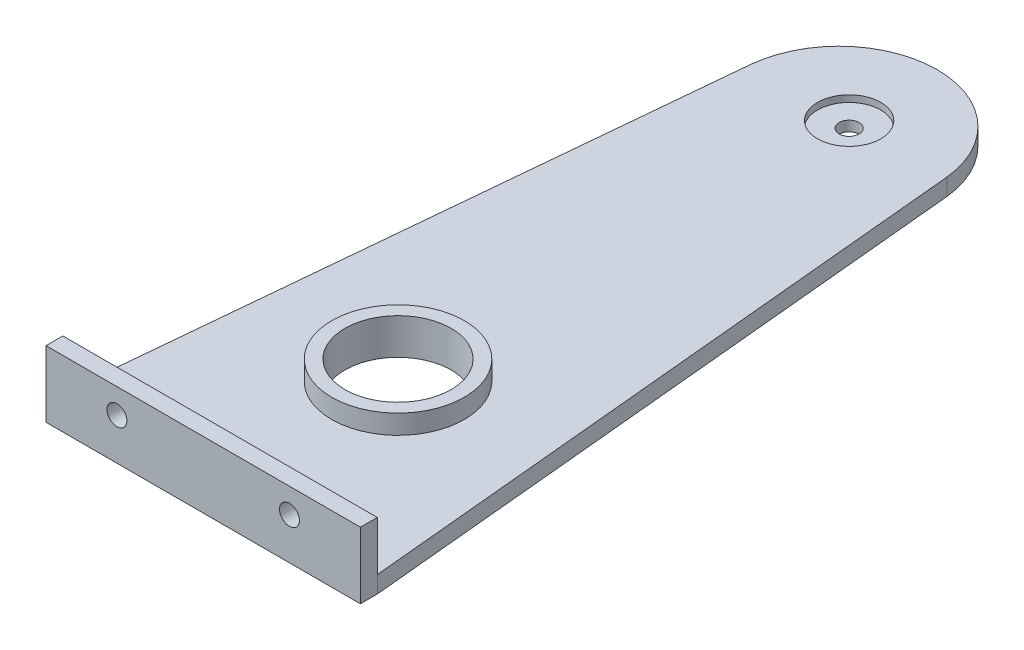
ISO-10303-21;
HEADER;
FILE_DESCRIPTION(('STEP AP214'),'2;1');
FILE_NAME('part.step','',(''),(''),'','','');
FILE_SCHEMA(('AUTOMOTIVE_DESIGN { 1 0 10303 214 1 1 1 1 }'));
ENDSEC;
DATA;
#1=APPLICATION_CONTEXT('core data for automotive mechanical design processes');
#2=APPLICATION_PROTOCOL_DEFINITION('international standard','automotive_design',2000,#1);
#3=PRODUCT_CONTEXT('',#1,'mechanical');
#4=PRODUCT('Part','Part','',(#3));
#5=PRODUCT_RELATED_PRODUCT_CATEGORY('part','',(#4));
#6=PRODUCT_DEFINITION_FORMATION('','',#4);
#7=PRODUCT_DEFINITION_CONTEXT('part definition',#1,'design');
#8=PRODUCT_DEFINITION('design','',#6,#7);
#9=PRODUCT_DEFINITION_SHAPE('','',#8);
#10=(LENGTH_UNIT() NAMED_UNIT(*) SI_UNIT(.MILLI.,.METRE.));
#11=(NAMED_UNIT(*) PLANE_ANGLE_UNIT() SI_UNIT($,.RADIAN.));
#12=(NAMED_UNIT(*) SI_UNIT($,.STERADIAN.) SOLID_ANGLE_UNIT());
#13=UNCERTAINTY_MEASURE_WITH_UNIT(LENGTH_MEASURE(1.E-05),#10,'distance_accuracy_value','');
#14=(GEOMETRIC_REPRESENTATION_CONTEXT(3) GLOBAL_UNCERTAINTY_ASSIGNED_CONTEXT((#13)) GLOBAL_UNIT_ASSIGNED_CONTEXT((#10,
#11,#12)) REPRESENTATION_CONTEXT('',''));
#15=CARTESIAN_POINT('',(0.,0.,0.));
#16=DIRECTION('',(0.,0.,1.));
#17=DIRECTION('',(1.,0.,0.));
#18=AXIS2_PLACEMENT_3D('',#15,#16,#17);
#19=CARTESIAN_POINT('',(-0.0202063432006589,-2.54,0.));
#20=DIRECTION('',(0.,1.,0.));
#21=DIRECTION('',(0.,0.,1.));
#22=AXIS2_PLACEMENT_3D('',#19,#20,#21);
#23=CYLINDRICAL_SURFACE('',#22,1.5);
#24=CARTESIAN_POINT('',(-0.0202063432006589,-2.54,0.));
#25=DIRECTION('',(0.,1.,0.));
#26=DIRECTION('',(0.,0.,1.));
#27=AXIS2_PLACEMENT_3D('',#24,#25,#26);
#28=CIRCLE('',#27,1.5);
#29=CARTESIAN_POINT('',(-0.0202063432006589,-2.54,1.50000000000003));
#30=VERTEX_POINT('',#29);
#31=EDGE_CURVE('E133',#30,#30,#28,.F.);
#32=ORIENTED_EDGE('',*,*,#31,.T.);
#33=EDGE_LOOP('',(#32));
#34=FACE_BOUND('',#33,.T.);
#35=CARTESIAN_POINT('',(-0.0202063432006589,-1.,0.));
#36=DIRECTION('',(0.,1.,0.));
#37=DIRECTION('',(0.,0.,1.));
#38=AXIS2_PLACEMENT_3D('',#35,#36,#37);
#39=CIRCLE('',#38,1.5);
#40=CARTESIAN_POINT('',(-0.0202063432006589,-1.,1.50000000000003));
#41=VERTEX_POINT('',#40);
#42=EDGE_CURVE('E182',#41,#41,#39,.F.);
#43=ORIENTED_EDGE('',*,*,#42,.F.);
#44=EDGE_LOOP('',(#43));
#45=FACE_BOUND('',#44,.T.);
#46=ADVANCED_FACE('F35',(#34,#45),#23,.F.);
#47=CARTESIAN_POINT('',(0.,0.,0.));
#48=DIRECTION('',(0.,1.,0.));
#49=DIRECTION('',(0.,0.,1.));
#50=AXIS2_PLACEMENT_3D('',#47,#48,#49);
#51=PLANE('',#50);
#52=CARTESIAN_POINT('',(-0.000200836754732192,0.,67.9999970572037));
#53=DIRECTION('',(0.,1.,0.));
#54=DIRECTION('',(0.,0.,1.));
#55=AXIS2_PLACEMENT_3D('',#52,#53,#54);
#56=CIRCLE('',#55,10.);
#57=CARTESIAN_POINT('',(-0.000200836754732192,0.,77.9999970572037));
#58=VERTEX_POINT('',#57);
#59=EDGE_CURVE('E11',#58,#58,#56,.T.);
#60=ORIENTED_EDGE('',*,*,#59,.F.);
#61=EDGE_LOOP('',(#60));
#62=FACE_BOUND('',#61,.T.);
#63=DIRECTION('',(0.0941057343410475,0.,0.995562208384856));
#64=VECTOR('',#63,1.);
#65=CARTESIAN_POINT('',(14.5881691243835,0.,-1.37894986026911));
#66=LINE('',#65,#64);
#67=CARTESIAN_POINT('',(14.7185146599283,0.,0.));
#68=VERTEX_POINT('',#67);
#69=CARTESIAN_POINT('',(23.6803571196277,0.,94.8090117233565));
#70=VERTEX_POINT('',#69);
#71=EDGE_CURVE('E125',#68,#70,#66,.T.);
#72=ORIENTED_EDGE('',*,*,#71,.F.);
#73=CARTESIAN_POINT('',(-0.0202063432006572,0.,1.53641351594778));
#74=DIRECTION('',(0.,1.,0.));
#75=DIRECTION('',(0.,0.,1.));
#76=AXIS2_PLACEMENT_3D('',#73,#74,#75);
#77=CIRCLE('',#76,14.8185850640357);
#78=CARTESIAN_POINT('',(-14.7589273463297,0.,0.));
#79=VERTEX_POINT('',#78);
#80=EDGE_CURVE('E127',#68,#79,#77,.T.);
#81=ORIENTED_EDGE('',*,*,#80,.T.);
#82=DIRECTION('',(-0.0938954260904472,0.,0.995582065406611));
#83=VECTOR('',#82,1.);
#84=CARTESIAN_POINT('',(-14.6288074618601,0.,-1.37967341674187));
#85=LINE('',#84,#83);
#86=CARTESIAN_POINT('',(-23.700563462829,0.,94.8090117233565));
#87=VERTEX_POINT('',#86);
#88=EDGE_CURVE('E146',#79,#87,#85,.T.);
#89=ORIENTED_EDGE('',*,*,#88,.T.);
#90=DIRECTION('',(-1.,0.,0.));
#91=VECTOR('',#90,1.);
#92=CARTESIAN_POINT('',(0.,0.,94.8090117233565));
#93=LINE('',#92,#91);
#94=EDGE_CURVE('E75',#70,#87,#93,.T.);
#95=ORIENTED_EDGE('',*,*,#94,.F.);
#96=EDGE_LOOP('',(#72,#81,#89,#95));
#97=FACE_BOUND('',#96,.T.);
#98=CARTESIAN_POINT('',(-0.0202063432006589,0.,0.));
#99=DIRECTION('',(0.,1.,0.));
#100=DIRECTION('',(0.,0.,1.));
#101=AXIS2_PLACEMENT_3D('',#98,#99,#100);
#102=CIRCLE('',#101,4.7625);
#103=CARTESIAN_POINT('',(-0.0202063432006589,0.,4.76250000000003));
#104=VERTEX_POINT('',#103);
#105=EDGE_CURVE('E191',#104,#104,#102,.F.);
#106=ORIENTED_EDGE('',*,*,#105,.T.);
#107=EDGE_LOOP('',(#106));
#108=FACE_BOUND('',#107,.T.);
#109=ADVANCED_FACE('F156',(#62,#97,#108),#51,.T.);
#110=CARTESIAN_POINT('',(14.5881691243835,-2.54,-1.37894986026911));
#111=DIRECTION('',(-0.995562208384856,0.,0.0941057343410474));
#112=DIRECTION('',(0.0941057343410475,0.,0.995562208384857));
#113=AXIS2_PLACEMENT_3D('',#110,#111,#112);
#114=PLANE('',#113);
#115=ORIENTED_EDGE('',*,*,#71,.T.);
#116=DIRECTION('',(0.,1.,0.));
#117=VECTOR('',#116,1.);
#118=CARTESIAN_POINT('',(23.6803571196277,-2.54,94.8090117233565));
#119=LINE('',#118,#117);
#120=CARTESIAN_POINT('',(23.6803571196277,-2.54,94.8090117233565));
#121=VERTEX_POINT('',#120);
#122=EDGE_CURVE('E43',#121,#70,#119,.T.);
#123=ORIENTED_EDGE('',*,*,#122,.F.);
#124=DIRECTION('',(0.0941057343410475,0.,0.995562208384856));
#125=VECTOR('',#124,1.);
#126=CARTESIAN_POINT('',(14.5881691243835,-2.54,-1.37894986026911));
#127=LINE('',#126,#125);
#128=CARTESIAN_POINT('',(14.7185146599283,-2.54,0.));
#129=VERTEX_POINT('',#128);
#130=EDGE_CURVE('E51',#129,#121,#127,.T.);
#131=ORIENTED_EDGE('',*,*,#130,.F.);
#132=DIRECTION('',(0.,1.,0.));
#133=VECTOR('',#132,1.);
#134=CARTESIAN_POINT('',(14.7185146599283,-2.54,0.));
#135=LINE('',#134,#133);
#136=EDGE_CURVE('E79',#129,#68,#135,.T.);
#137=ORIENTED_EDGE('',*,*,#136,.T.);
#138=EDGE_LOOP('',(#115,#123,#131,#137));
#139=FACE_BOUND('',#138,.T.);
#140=ADVANCED_FACE('F154',(#139),#114,.F.);
#141=CARTESIAN_POINT('',(-14.6288074618601,-2.54,-1.37967341674187));
#142=DIRECTION('',(-0.995582065406611,0.,-0.0938954260904472));
#143=DIRECTION('',(-0.0938954260904472,0.,0.995582065406611));
#144=AXIS2_PLACEMENT_3D('',#141,#142,#143);
#145=PLANE('',#144);
#146=ORIENTED_EDGE('',*,*,#88,.F.);
#147=DIRECTION('',(0.,1.,0.));
#148=VECTOR('',#147,1.);
#149=CARTESIAN_POINT('',(-14.7589273463297,-2.54,0.));
#150=LINE('',#149,#148);
#151=CARTESIAN_POINT('',(-14.7589273463297,-2.54,0.));
#152=VERTEX_POINT('',#151);
#153=EDGE_CURVE('E67',#152,#79,#150,.T.);
#154=ORIENTED_EDGE('',*,*,#153,.F.);
#155=DIRECTION('',(-0.0938954260904472,0.,0.995582065406611));
#156=VECTOR('',#155,1.);
#157=CARTESIAN_POINT('',(-14.6288074618601,-2.54,-1.37967341674187));
#158=LINE('',#157,#156);
#159=CARTESIAN_POINT('',(-23.700563462829,-2.54,94.8090117233565));
#160=VERTEX_POINT('',#159);
#161=EDGE_CURVE('E139',#152,#160,#158,.T.);
#162=ORIENTED_EDGE('',*,*,#161,.T.);
#163=DIRECTION('',(0.,1.,0.));
#164=VECTOR('',#163,1.);
#165=CARTESIAN_POINT('',(-23.700563462829,-2.54,94.8090117233565));
#166=LINE('',#165,#164);
#167=EDGE_CURVE('E150',#160,#87,#166,.T.);
#168=ORIENTED_EDGE('',*,*,#167,.T.);
#169=EDGE_LOOP('',(#146,#154,#162,#168));
#170=FACE_BOUND('',#169,.T.);
#171=ADVANCED_FACE('F161',(#170),#145,.T.);
#172=CARTESIAN_POINT('',(-0.0202063432006572,-2.54,1.53641351594778));
#173=DIRECTION('',(0.,1.,0.));
#174=DIRECTION('',(0.,0.,1.));
#175=AXIS2_PLACEMENT_3D('',#172,#173,#174);
#176=CYLINDRICAL_SURFACE('',#175,14.8185850640357);
#177=ORIENTED_EDGE('',*,*,#80,.F.);
#178=ORIENTED_EDGE('',*,*,#136,.F.);
#179=CARTESIAN_POINT('',(-0.0202063432006572,-2.54,1.53641351594778));
#180=DIRECTION('',(0.,1.,0.));
#181=DIRECTION('',(0.,0.,1.));
#182=AXIS2_PLACEMENT_3D('',#179,#180,#181);
#183=CIRCLE('',#182,14.8185850640357);
#184=EDGE_CURVE('E137',#129,#152,#183,.T.);
#185=ORIENTED_EDGE('',*,*,#184,.T.);
#186=ORIENTED_EDGE('',*,*,#153,.T.);
#187=EDGE_LOOP('',(#177,#178,#185,#186));
#188=FACE_BOUND('',#187,.T.);
#189=ADVANCED_FACE('F158',(#188),#176,.T.);
#190=CARTESIAN_POINT('',(-0.000200836754732192,-2.54,67.9999970572037));
#191=DIRECTION('',(0.,1.,0.));
#192=DIRECTION('',(0.,0.,1.));
#193=AXIS2_PLACEMENT_3D('',#190,#191,#192);
#194=CYLINDRICAL_SURFACE('',#193,8.00000000000001);
#195=CARTESIAN_POINT('',(-0.000200836754732192,-2.54,67.9999970572037));
#196=DIRECTION('',(0.,1.,0.));
#197=DIRECTION('',(0.,0.,1.));
#198=AXIS2_PLACEMENT_3D('',#195,#196,#197);
#199=CIRCLE('',#198,8.00000000000001);
#200=CARTESIAN_POINT('',(-0.000200836754732192,-2.54,75.9999970572037));
#201=VERTEX_POINT('',#200);
#202=EDGE_CURVE('E141',#201,#201,#199,.F.);
#203=ORIENTED_EDGE('',*,*,#202,.T.);
#204=EDGE_LOOP('',(#203));
#205=FACE_BOUND('',#204,.T.);
#206=CARTESIAN_POINT('',(-0.000200836754732192,2.9,67.9999970572037));
#207=DIRECTION('',(0.,1.,0.));
#208=DIRECTION('',(0.,0.,1.));
#209=AXIS2_PLACEMENT_3D('',#206,#207,#208);
#210=CIRCLE('',#209,8.00000000000001);
#211=CARTESIAN_POINT('',(-0.000200836754732192,2.9,75.9999970572037));
#212=VERTEX_POINT('',#211);
#213=EDGE_CURVE('E197',#212,#212,#210,.F.);
#214=ORIENTED_EDGE('',*,*,#213,.F.);
#215=EDGE_LOOP('',(#214));
#216=FACE_BOUND('',#215,.T.);
#217=ADVANCED_FACE('F160',(#205,#216),#194,.F.);
#218=CARTESIAN_POINT('',(0.,-2.54,0.));
#219=DIRECTION('',(0.,1.,0.));
#220=DIRECTION('',(0.,0.,1.));
#221=AXIS2_PLACEMENT_3D('',#218,#219,#220);
#222=PLANE('',#221);
#223=ORIENTED_EDGE('',*,*,#31,.F.);
#224=EDGE_LOOP('',(#223));
#225=FACE_BOUND('',#224,.T.);
#226=ORIENTED_EDGE('',*,*,#130,.T.);
#227=DIRECTION('',(0.,0.,-1.));
#228=VECTOR('',#227,1.);
#229=CARTESIAN_POINT('',(23.6803571196277,-2.54,97.3490117233565));
#230=LINE('',#229,#228);
#231=CARTESIAN_POINT('',(23.6803571196277,-2.54,97.3490117233565));
#232=VERTEX_POINT('',#231);
#233=EDGE_CURVE('E106',#232,#121,#230,.T.);
#234=ORIENTED_EDGE('',*,*,#233,.F.);
#235=DIRECTION('',(1.,0.,0.));
#236=VECTOR('',#235,1.);
#237=CARTESIAN_POINT('',(23.6803571196277,-2.54,97.3490117233565));
#238=LINE('',#237,#236);
#239=CARTESIAN_POINT('',(-23.700563462829,-2.54,97.3490117233565));
#240=VERTEX_POINT('',#239);
#241=EDGE_CURVE('E112',#240,#232,#238,.T.);
#242=ORIENTED_EDGE('',*,*,#241,.F.);
#243=DIRECTION('',(0.,0.,-1.));
#244=VECTOR('',#243,1.);
#245=CARTESIAN_POINT('',(-23.700563462829,-2.54,97.3490117233565));
#246=LINE('',#245,#244);
#247=EDGE_CURVE('E209',#240,#160,#246,.T.);
#248=ORIENTED_EDGE('',*,*,#247,.T.);
#249=ORIENTED_EDGE('',*,*,#161,.F.);
#250=ORIENTED_EDGE('',*,*,#184,.F.);
#251=EDGE_LOOP('',(#226,#234,#242,#248,#249,#250));
#252=FACE_BOUND('',#251,.T.);
#253=ORIENTED_EDGE('',*,*,#202,.F.);
#254=EDGE_LOOP('',(#253));
#255=FACE_BOUND('',#254,.T.);
#256=ADVANCED_FACE('F123',(#225,#252,#255),#222,.F.);
#257=CARTESIAN_POINT('',(0.,0.,97.3490117233565));
#258=DIRECTION('',(0.,0.,-1.));
#259=DIRECTION('',(-1.,0.,0.));
#260=AXIS2_PLACEMENT_3D('',#257,#258,#259);
#261=PLANE('',#260);
#262=ORIENTED_EDGE('',*,*,#241,.T.);
#263=DIRECTION('',(0.,1.,0.));
#264=VECTOR('',#263,1.);
#265=CARTESIAN_POINT('',(23.6803571196277,-2.54,97.3490117233565));
#266=LINE('',#265,#264);
#267=CARTESIAN_POINT('',(23.6803571196277,7.46,97.3490117233565));
#268=VERTEX_POINT('',#267);
#269=EDGE_CURVE('E102',#232,#268,#266,.T.);
#270=ORIENTED_EDGE('',*,*,#269,.T.);
#271=DIRECTION('',(-1.,0.,0.));
#272=VECTOR('',#271,1.);
#273=CARTESIAN_POINT('',(23.6803571196277,7.46,97.3490117233565));
#274=LINE('',#273,#272);
#275=CARTESIAN_POINT('',(-23.700563462829,7.46,97.3490117233565));
#276=VERTEX_POINT('',#275);
#277=EDGE_CURVE('E111',#268,#276,#274,.T.);
#278=ORIENTED_EDGE('',*,*,#277,.T.);
#279=DIRECTION('',(0.,-1.,0.));
#280=VECTOR('',#279,1.);
#281=CARTESIAN_POINT('',(-23.700563462829,-2.54,97.3490117233565));
#282=LINE('',#281,#280);
#283=EDGE_CURVE('E118',#276,#240,#282,.T.);
#284=ORIENTED_EDGE('',*,*,#283,.T.);
#285=EDGE_LOOP('',(#262,#270,#278,#284));
#286=FACE_BOUND('',#285,.T.);
#287=CARTESIAN_POINT('',(-13.0101031716007,3.73,97.3490117233565));
#288=DIRECTION('',(0.,0.,1.));
#289=DIRECTION('',(-1.,0.,0.));
#290=AXIS2_PLACEMENT_3D('',#287,#288,#289);
#291=CIRCLE('',#290,1.5);
#292=CARTESIAN_POINT('',(-14.5101031716007,3.73,97.3490117233565));
#293=VERTEX_POINT('',#292);
#294=EDGE_CURVE('E201',#293,#293,#291,.T.);
#295=ORIENTED_EDGE('',*,*,#294,.F.);
#296=EDGE_LOOP('',(#295));
#297=FACE_BOUND('',#296,.T.);
#298=CARTESIAN_POINT('',(12.9898968283993,3.73,97.3490117233565));
#299=DIRECTION('',(0.,0.,1.));
#300=DIRECTION('',(-1.,0.,0.));
#301=AXIS2_PLACEMENT_3D('',#298,#299,#300);
#302=CIRCLE('',#301,1.5);
#303=CARTESIAN_POINT('',(11.4898968283993,3.73,97.3490117233565));
#304=VERTEX_POINT('',#303);
#305=EDGE_CURVE('E188',#304,#304,#302,.T.);
#306=ORIENTED_EDGE('',*,*,#305,.F.);
#307=EDGE_LOOP('',(#306));
#308=FACE_BOUND('',#307,.T.);
#309=ADVANCED_FACE('F115',(#286,#297,#308),#261,.F.);
#310=CARTESIAN_POINT('',(0.,0.,94.8090117233565));
#311=DIRECTION('',(0.,0.,-1.));
#312=DIRECTION('',(-1.,0.,0.));
#313=AXIS2_PLACEMENT_3D('',#310,#311,#312);
#314=PLANE('',#313);
#315=CARTESIAN_POINT('',(-13.0101031716007,3.73,94.8090117233565));
#316=DIRECTION('',(0.,0.,1.));
#317=DIRECTION('',(-1.,0.,0.));
#318=AXIS2_PLACEMENT_3D('',#315,#316,#317);
#319=CIRCLE('',#318,1.5);
#320=CARTESIAN_POINT('',(-14.5101031716007,3.73,94.8090117233565));
#321=VERTEX_POINT('',#320);
#322=EDGE_CURVE('E199',#321,#321,#319,.T.);
#323=ORIENTED_EDGE('',*,*,#322,.T.);
#324=EDGE_LOOP('',(#323));
#325=FACE_BOUND('',#324,.T.);
#326=DIRECTION('',(0.,1.,0.));
#327=VECTOR('',#326,1.);
#328=CARTESIAN_POINT('',(23.6803571196277,-2.54,94.8090117233565));
#329=LINE('',#328,#327);
#330=CARTESIAN_POINT('',(23.6803571196277,7.46,94.8090117233565));
#331=VERTEX_POINT('',#330);
#332=EDGE_CURVE('E204',#70,#331,#329,.T.);
#333=ORIENTED_EDGE('',*,*,#332,.F.);
#334=ORIENTED_EDGE('',*,*,#94,.T.);
#335=DIRECTION('',(0.,-1.,0.));
#336=VECTOR('',#335,1.);
#337=CARTESIAN_POINT('',(-23.700563462829,-2.54,94.8090117233565));
#338=LINE('',#337,#336);
#339=CARTESIAN_POINT('',(-23.700563462829,7.46,94.8090117233565));
#340=VERTEX_POINT('',#339);
#341=EDGE_CURVE('E121',#340,#87,#338,.T.);
#342=ORIENTED_EDGE('',*,*,#341,.F.);
#343=DIRECTION('',(-1.,0.,0.));
#344=VECTOR('',#343,1.);
#345=CARTESIAN_POINT('',(23.6803571196277,7.46,94.8090117233565));
#346=LINE('',#345,#344);
#347=EDGE_CURVE('E211',#331,#340,#346,.T.);
#348=ORIENTED_EDGE('',*,*,#347,.F.);
#349=EDGE_LOOP('',(#333,#334,#342,#348));
#350=FACE_BOUND('',#349,.T.);
#351=CARTESIAN_POINT('',(12.9898968283993,3.73,94.8090117233565));
#352=DIRECTION('',(0.,0.,1.));
#353=DIRECTION('',(-1.,0.,0.));
#354=AXIS2_PLACEMENT_3D('',#351,#352,#353);
#355=CIRCLE('',#354,1.5);
#356=CARTESIAN_POINT('',(11.4898968283993,3.73,94.8090117233565));
#357=VERTEX_POINT('',#356);
#358=EDGE_CURVE('E184',#357,#357,#355,.T.);
#359=ORIENTED_EDGE('',*,*,#358,.T.);
#360=EDGE_LOOP('',(#359));
#361=FACE_BOUND('',#360,.T.);
#362=ADVANCED_FACE('F224',(#325,#350,#361),#314,.T.);
#363=CARTESIAN_POINT('',(23.6803571196277,-2.54,97.3490117233565));
#364=DIRECTION('',(-1.,0.,0.));
#365=DIRECTION('',(0.,0.,1.));
#366=AXIS2_PLACEMENT_3D('',#363,#364,#365);
#367=PLANE('',#366);
#368=ORIENTED_EDGE('',*,*,#122,.T.);
#369=ORIENTED_EDGE('',*,*,#332,.T.);
#370=DIRECTION('',(0.,0.,-1.));
#371=VECTOR('',#370,1.);
#372=CARTESIAN_POINT('',(23.6803571196277,7.46,97.3490117233565));
#373=LINE('',#372,#371);
#374=EDGE_CURVE('E108',#268,#331,#373,.T.);
#375=ORIENTED_EDGE('',*,*,#374,.F.);
#376=ORIENTED_EDGE('',*,*,#269,.F.);
#377=ORIENTED_EDGE('',*,*,#233,.T.);
#378=EDGE_LOOP('',(#368,#369,#375,#376,#377));
#379=FACE_BOUND('',#378,.T.);
#380=ADVANCED_FACE('F105',(#379),#367,.F.);
#381=CARTESIAN_POINT('',(23.6803571196277,7.46,97.3490117233565));
#382=DIRECTION('',(0.,-1.,0.));
#383=DIRECTION('',(0.,0.,-1.));
#384=AXIS2_PLACEMENT_3D('',#381,#382,#383);
#385=PLANE('',#384);
#386=ORIENTED_EDGE('',*,*,#347,.T.);
#387=DIRECTION('',(0.,0.,-1.));
#388=VECTOR('',#387,1.);
#389=CARTESIAN_POINT('',(-23.700563462829,7.46,97.3490117233565));
#390=LINE('',#389,#388);
#391=EDGE_CURVE('E129',#276,#340,#390,.T.);
#392=ORIENTED_EDGE('',*,*,#391,.F.);
#393=ORIENTED_EDGE('',*,*,#277,.F.);
#394=ORIENTED_EDGE('',*,*,#374,.T.);
#395=EDGE_LOOP('',(#386,#392,#393,#394));
#396=FACE_BOUND('',#395,.T.);
#397=ADVANCED_FACE('F226',(#396),#385,.F.);
#398=CARTESIAN_POINT('',(-23.700563462829,-2.54,97.3490117233565));
#399=DIRECTION('',(1.,0.,0.));
#400=DIRECTION('',(0.,0.,-1.));
#401=AXIS2_PLACEMENT_3D('',#398,#399,#400);
#402=PLANE('',#401);
#403=ORIENTED_EDGE('',*,*,#341,.T.);
#404=ORIENTED_EDGE('',*,*,#167,.F.);
#405=ORIENTED_EDGE('',*,*,#247,.F.);
#406=ORIENTED_EDGE('',*,*,#283,.F.);
#407=ORIENTED_EDGE('',*,*,#391,.T.);
#408=EDGE_LOOP('',(#403,#404,#405,#406,#407));
#409=FACE_BOUND('',#408,.T.);
#410=ADVANCED_FACE('F219',(#409),#402,.F.);
#411=CARTESIAN_POINT('',(-13.0101031716007,3.73,97.3490117233565));
#412=DIRECTION('',(0.,0.,-1.));
#413=DIRECTION('',(-1.,0.,0.));
#414=AXIS2_PLACEMENT_3D('',#411,#412,#413);
#415=CYLINDRICAL_SURFACE('',#414,1.5);
#416=ORIENTED_EDGE('',*,*,#294,.T.);
#417=EDGE_LOOP('',(#416));
#418=FACE_BOUND('',#417,.T.);
#419=ORIENTED_EDGE('',*,*,#322,.F.);
#420=EDGE_LOOP('',(#419));
#421=FACE_BOUND('',#420,.T.);
#422=ADVANCED_FACE('F233',(#418,#421),#415,.F.);
#423=CARTESIAN_POINT('',(12.9898968283993,3.73,97.3490117233565));
#424=DIRECTION('',(0.,0.,-1.));
#425=DIRECTION('',(-1.,0.,0.));
#426=AXIS2_PLACEMENT_3D('',#423,#424,#425);
#427=CYLINDRICAL_SURFACE('',#426,1.5);
#428=ORIENTED_EDGE('',*,*,#305,.T.);
#429=EDGE_LOOP('',(#428));
#430=FACE_BOUND('',#429,.T.);
#431=ORIENTED_EDGE('',*,*,#358,.F.);
#432=EDGE_LOOP('',(#431));
#433=FACE_BOUND('',#432,.T.);
#434=ADVANCED_FACE('F251',(#430,#433),#427,.F.);
#435=CARTESIAN_POINT('',(-0.0202063432006589,-1.,0.));
#436=DIRECTION('',(0.,1.,0.));
#437=DIRECTION('',(0.,0.,1.));
#438=AXIS2_PLACEMENT_3D('',#435,#436,#437);
#439=CYLINDRICAL_SURFACE('',#438,4.7625);
#440=CARTESIAN_POINT('',(-0.0202063432006589,-1.,0.));
#441=DIRECTION('',(0.,1.,0.));
#442=DIRECTION('',(0.,0.,1.));
#443=AXIS2_PLACEMENT_3D('',#440,#441,#442);
#444=CIRCLE('',#443,4.7625);
#445=CARTESIAN_POINT('',(-0.0202063432006589,-1.,4.76250000000003));
#446=VERTEX_POINT('',#445);
#447=EDGE_CURVE('E185',#446,#446,#444,.F.);
#448=ORIENTED_EDGE('',*,*,#447,.T.);
#449=EDGE_LOOP('',(#448));
#450=FACE_BOUND('',#449,.T.);
#451=ORIENTED_EDGE('',*,*,#105,.F.);
#452=EDGE_LOOP('',(#451));
#453=FACE_BOUND('',#452,.T.);
#454=ADVANCED_FACE('F255',(#450,#453),#439,.F.);
#455=CARTESIAN_POINT('',(0.,-1.,0.));
#456=DIRECTION('',(0.,1.,0.));
#457=DIRECTION('',(0.,0.,1.));
#458=AXIS2_PLACEMENT_3D('',#455,#456,#457);
#459=PLANE('',#458);
#460=ORIENTED_EDGE('',*,*,#447,.F.);
#461=EDGE_LOOP('',(#460));
#462=FACE_BOUND('',#461,.T.);
#463=ORIENTED_EDGE('',*,*,#42,.T.);
#464=EDGE_LOOP('',(#463));
#465=FACE_BOUND('',#464,.T.);
#466=ADVANCED_FACE('F259',(#462,#465),#459,.T.);
#467=CARTESIAN_POINT('',(-0.000200836754732192,2.9,67.9999970572037));
#468=DIRECTION('',(0.,-1.,0.));
#469=DIRECTION('',(0.,0.,-1.));
#470=AXIS2_PLACEMENT_3D('',#467,#468,#469);
#471=CYLINDRICAL_SURFACE('',#470,10.);
#472=CARTESIAN_POINT('',(-0.000200836754732192,2.9,67.9999970572037));
#473=DIRECTION('',(0.,1.,0.));
#474=DIRECTION('',(0.,0.,1.));
#475=AXIS2_PLACEMENT_3D('',#472,#473,#474);
#476=CIRCLE('',#475,10.);
#477=CARTESIAN_POINT('',(-0.000200836754732192,2.9,77.9999970572037));
#478=VERTEX_POINT('',#477);
#479=EDGE_CURVE('E276',#478,#478,#476,.F.);
#480=ORIENTED_EDGE('',*,*,#479,.T.);
#481=EDGE_LOOP('',(#480));
#482=FACE_BOUND('',#481,.T.);
#483=ORIENTED_EDGE('',*,*,#59,.T.);
#484=EDGE_LOOP('',(#483));
#485=FACE_BOUND('',#484,.T.);
#486=ADVANCED_FACE('F263',(#482,#485),#471,.T.);
#487=CARTESIAN_POINT('',(0.,2.9,0.));
#488=DIRECTION('',(0.,1.,0.));
#489=DIRECTION('',(0.,0.,1.));
#490=AXIS2_PLACEMENT_3D('',#487,#488,#489);
#491=PLANE('',#490);
#492=ORIENTED_EDGE('',*,*,#479,.F.);
#493=EDGE_LOOP('',(#492));
#494=FACE_BOUND('',#493,.T.);
#495=ORIENTED_EDGE('',*,*,#213,.T.);
#496=EDGE_LOOP('',(#495));
#497=FACE_BOUND('',#496,.T.);
#498=ADVANCED_FACE('F267',(#494,#497),#491,.T.);
#499=CLOSED_SHELL('',(#46,#109,#140,#171,#189,#217,#256,#309,#362,#380,#397,#410,#422,#434,#454,
#466,#486,#498));
#500=MANIFOLD_SOLID_BREP('B2',#499);
#501=ADVANCED_BREP_SHAPE_REPRESENTATION('',(#18,#500),#14);
#502=SHAPE_DEFINITION_REPRESENTATION(#9,#501);
ENDSEC;
END-ISO-10303-21;
